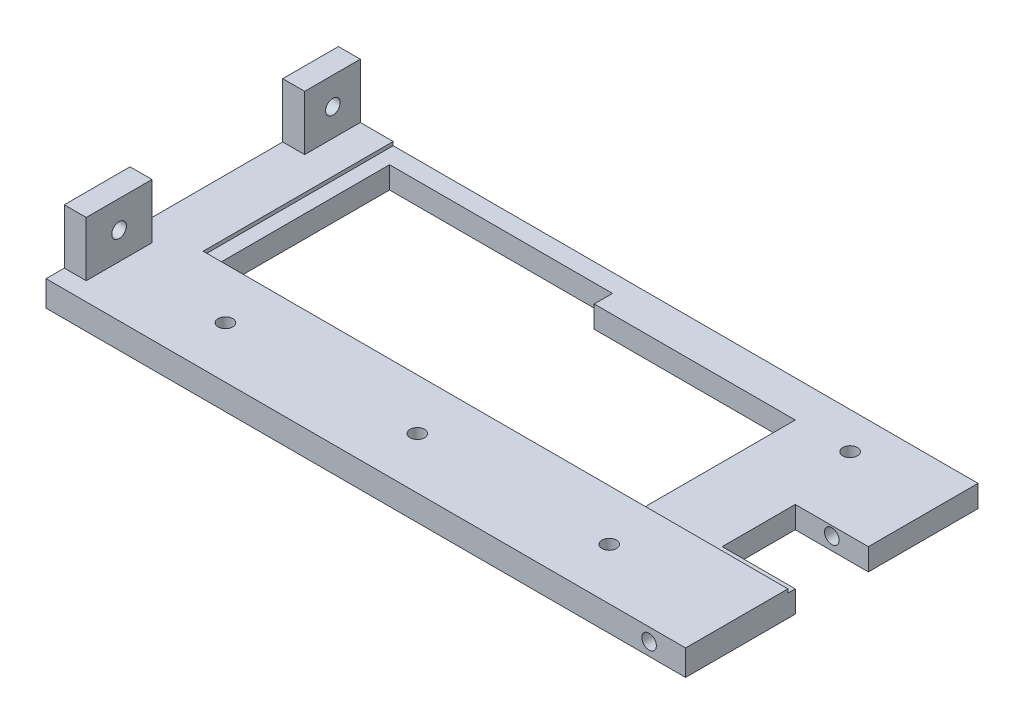
ISO-10303-21;
HEADER;
FILE_DESCRIPTION(('STEP AP214'),'2;1');
FILE_NAME('part.step','',(''),(''),'','','');
FILE_SCHEMA(('AUTOMOTIVE_DESIGN { 1 0 10303 214 1 1 1 1 }'));
ENDSEC;
DATA;
#1=APPLICATION_CONTEXT('core data for automotive mechanical design processes');
#2=APPLICATION_PROTOCOL_DEFINITION('international standard','automotive_design',2000,#1);
#3=PRODUCT_CONTEXT('',#1,'mechanical');
#4=PRODUCT('Part','Part','',(#3));
#5=PRODUCT_RELATED_PRODUCT_CATEGORY('part','',(#4));
#6=PRODUCT_DEFINITION_FORMATION('','',#4);
#7=PRODUCT_DEFINITION_CONTEXT('part definition',#1,'design');
#8=PRODUCT_DEFINITION('design','',#6,#7);
#9=PRODUCT_DEFINITION_SHAPE('','',#8);
#10=(LENGTH_UNIT() NAMED_UNIT(*) SI_UNIT(.MILLI.,.METRE.));
#11=(NAMED_UNIT(*) PLANE_ANGLE_UNIT() SI_UNIT($,.RADIAN.));
#12=(NAMED_UNIT(*) SI_UNIT($,.STERADIAN.) SOLID_ANGLE_UNIT());
#13=UNCERTAINTY_MEASURE_WITH_UNIT(LENGTH_MEASURE(1.E-05),#10,'distance_accuracy_value','');
#14=(GEOMETRIC_REPRESENTATION_CONTEXT(3) GLOBAL_UNCERTAINTY_ASSIGNED_CONTEXT((#13)) GLOBAL_UNIT_ASSIGNED_CONTEXT((#10,
#11,#12)) REPRESENTATION_CONTEXT('',''));
#15=CARTESIAN_POINT('',(0.,0.,0.));
#16=DIRECTION('',(0.,0.,1.));
#17=DIRECTION('',(1.,0.,0.));
#18=AXIS2_PLACEMENT_3D('',#15,#16,#17);
#19=CARTESIAN_POINT('',(85.1165501165501,7.,-33.006993006993));
#20=DIRECTION('',(-1.,0.,0.));
#21=DIRECTION('',(0.,0.,1.));
#22=AXIS2_PLACEMENT_3D('',#19,#20,#21);
#23=PLANE('',#22);
#24=DIRECTION('',(0.,0.,-1.));
#25=VECTOR('',#24,1.);
#26=CARTESIAN_POINT('',(85.1165501165501,6.,18.993006993007));
#27=LINE('',#26,#25);
#28=CARTESIAN_POINT('',(85.1165501165501,6.,-3.006993006993));
#29=VERTEX_POINT('',#28);
#30=CARTESIAN_POINT('',(85.1165501165501,6.,-33.006993006993));
#31=VERTEX_POINT('',#30);
#32=EDGE_CURVE('E388',#29,#31,#27,.T.);
#33=ORIENTED_EDGE('',*,*,#32,.F.);
#34=DIRECTION('',(0.,-1.,0.));
#35=VECTOR('',#34,1.);
#36=CARTESIAN_POINT('',(85.1165501165501,15.,-3.006993006993));
#37=LINE('',#36,#35);
#38=CARTESIAN_POINT('',(85.1165501165501,0.,-3.006993006993));
#39=VERTEX_POINT('',#38);
#40=EDGE_CURVE('E272',#29,#39,#37,.T.);
#41=ORIENTED_EDGE('',*,*,#40,.T.);
#42=DIRECTION('',(0.,0.,-1.));
#43=VECTOR('',#42,1.);
#44=CARTESIAN_POINT('',(85.1165501165501,0.,-33.006993006993));
#45=LINE('',#44,#43);
#46=CARTESIAN_POINT('',(85.1165501165501,0.,-33.006993006993));
#47=VERTEX_POINT('',#46);
#48=EDGE_CURVE('E223',#39,#47,#45,.T.);
#49=ORIENTED_EDGE('',*,*,#48,.T.);
#50=DIRECTION('',(0.,-1.,0.));
#51=VECTOR('',#50,1.);
#52=CARTESIAN_POINT('',(85.1165501165501,7.,-33.006993006993));
#53=LINE('',#52,#51);
#54=EDGE_CURVE('E234',#31,#47,#53,.T.);
#55=ORIENTED_EDGE('',*,*,#54,.F.);
#56=EDGE_LOOP('',(#33,#41,#49,#55));
#57=FACE_BOUND('',#56,.T.);
#58=ADVANCED_FACE('F33',(#57),#23,.F.);
#59=CARTESIAN_POINT('',(0.,7.,0.));
#60=DIRECTION('',(0.,1.,0.));
#61=DIRECTION('',(0.,0.,1.));
#62=AXIS2_PLACEMENT_3D('',#59,#60,#61);
#63=PLANE('',#62);
#64=CARTESIAN_POINT('',(-54.8834498834499,7.,32.893006993007));
#65=DIRECTION('',(0.,1.,0.));
#66=DIRECTION('',(0.,0.,1.));
#67=AXIS2_PLACEMENT_3D('',#64,#65,#66);
#68=CIRCLE('',#67,2.);
#69=CARTESIAN_POINT('',(-54.8834498834499,7.,34.893006993007));
#70=VERTEX_POINT('',#69);
#71=EDGE_CURVE('E246',#70,#70,#68,.T.);
#72=ORIENTED_EDGE('',*,*,#71,.F.);
#73=EDGE_LOOP('',(#72));
#74=FACE_BOUND('',#73,.T.);
#75=CARTESIAN_POINT('',(-2.38344988344989,7.,32.893006993007));
#76=DIRECTION('',(0.,1.,0.));
#77=DIRECTION('',(0.,0.,1.));
#78=AXIS2_PLACEMENT_3D('',#75,#76,#77);
#79=CIRCLE('',#78,2.);
#80=CARTESIAN_POINT('',(-2.38344988344989,7.,34.893006993007));
#81=VERTEX_POINT('',#80);
#82=EDGE_CURVE('E412',#81,#81,#79,.T.);
#83=ORIENTED_EDGE('',*,*,#82,.F.);
#84=EDGE_LOOP('',(#83));
#85=FACE_BOUND('',#84,.T.);
#86=CARTESIAN_POINT('',(50.1165501165501,7.,32.893006993007));
#87=DIRECTION('',(0.,1.,0.));
#88=DIRECTION('',(0.,0.,1.));
#89=AXIS2_PLACEMENT_3D('',#86,#87,#88);
#90=CIRCLE('',#89,2.);
#91=CARTESIAN_POINT('',(50.1165501165501,7.,34.893006993007));
#92=VERTEX_POINT('',#91);
#93=EDGE_CURVE('E406',#92,#92,#90,.T.);
#94=ORIENTED_EDGE('',*,*,#93,.F.);
#95=EDGE_LOOP('',(#94));
#96=FACE_BOUND('',#95,.T.);
#97=DIRECTION('',(0.,0.,-1.));
#98=VECTOR('',#97,1.);
#99=CARTESIAN_POINT('',(-83.8834498834499,7.,41.993006993007));
#100=LINE('',#99,#98);
#101=CARTESIAN_POINT('',(-83.8834498834499,7.,41.993006993007));
#102=VERTEX_POINT('',#101);
#103=CARTESIAN_POINT('',(-83.8834498834499,7.,23.993006993007));
#104=VERTEX_POINT('',#103);
#105=EDGE_CURVE('E303',#102,#104,#100,.T.);
#106=ORIENTED_EDGE('',*,*,#105,.F.);
#107=DIRECTION('',(1.,0.,0.));
#108=VECTOR('',#107,1.);
#109=CARTESIAN_POINT('',(-89.8834498834499,7.,41.993006993007));
#110=LINE('',#109,#108);
#111=CARTESIAN_POINT('',(-89.8834498834499,7.,41.993006993007));
#112=VERTEX_POINT('',#111);
#113=EDGE_CURVE('E290',#112,#102,#110,.T.);
#114=ORIENTED_EDGE('',*,*,#113,.F.);
#115=DIRECTION('',(0.,0.,1.));
#116=VECTOR('',#115,1.);
#117=CARTESIAN_POINT('',(-89.8834498834499,7.,-33.006993006993));
#118=LINE('',#117,#116);
#119=CARTESIAN_POINT('',(-89.8834498834499,7.,46.993006993007));
#120=VERTEX_POINT('',#119);
#121=EDGE_CURVE('E225',#112,#120,#118,.T.);
#122=ORIENTED_EDGE('',*,*,#121,.T.);
#123=DIRECTION('',(1.,0.,0.));
#124=VECTOR('',#123,1.);
#125=CARTESIAN_POINT('',(-89.8834498834499,7.,46.993006993007));
#126=LINE('',#125,#124);
#127=CARTESIAN_POINT('',(85.1165501165501,7.,46.993006993007));
#128=VERTEX_POINT('',#127);
#129=EDGE_CURVE('E420',#120,#128,#126,.T.);
#130=ORIENTED_EDGE('',*,*,#129,.T.);
#131=DIRECTION('',(0.,0.,-1.));
#132=VECTOR('',#131,1.);
#133=CARTESIAN_POINT('',(85.1165501165501,7.,-33.006993006993));
#134=LINE('',#133,#132);
#135=CARTESIAN_POINT('',(85.1165501165501,7.,18.993006993007));
#136=VERTEX_POINT('',#135);
#137=EDGE_CURVE('E422',#128,#136,#134,.T.);
#138=ORIENTED_EDGE('',*,*,#137,.T.);
#139=DIRECTION('',(1.,0.,0.));
#140=VECTOR('',#139,1.);
#141=CARTESIAN_POINT('',(85.1165501165501,7.,18.993006993007));
#142=LINE('',#141,#140);
#143=CARTESIAN_POINT('',(-74.8834498834499,7.,18.993006993007));
#144=VERTEX_POINT('',#143);
#145=EDGE_CURVE('E401',#144,#136,#142,.T.);
#146=ORIENTED_EDGE('',*,*,#145,.F.);
#147=DIRECTION('',(0.,0.,1.));
#148=VECTOR('',#147,1.);
#149=CARTESIAN_POINT('',(-74.8834498834499,7.,18.993006993007));
#150=LINE('',#149,#148);
#151=CARTESIAN_POINT('',(-74.8834498834499,7.,-33.006993006993));
#152=VERTEX_POINT('',#151);
#153=EDGE_CURVE('E384',#152,#144,#150,.T.);
#154=ORIENTED_EDGE('',*,*,#153,.F.);
#155=DIRECTION('',(-1.,0.,0.));
#156=VECTOR('',#155,1.);
#157=CARTESIAN_POINT('',(-89.8834498834499,7.,-33.006993006993));
#158=LINE('',#157,#156);
#159=CARTESIAN_POINT('',(-83.8834498834499,7.,-33.006993006993));
#160=VERTEX_POINT('',#159);
#161=EDGE_CURVE('E235',#152,#160,#158,.T.);
#162=ORIENTED_EDGE('',*,*,#161,.T.);
#163=DIRECTION('',(0.,0.,-1.));
#164=VECTOR('',#163,1.);
#165=CARTESIAN_POINT('',(-83.8834498834499,7.,-33.006993006993));
#166=LINE('',#165,#164);
#167=CARTESIAN_POINT('',(-83.8834498834499,7.,-17.7803002518982));
#168=VERTEX_POINT('',#167);
#169=EDGE_CURVE('E319',#168,#160,#166,.T.);
#170=ORIENTED_EDGE('',*,*,#169,.F.);
#171=DIRECTION('',(1.,0.,0.));
#172=VECTOR('',#171,1.);
#173=CARTESIAN_POINT('',(-89.8834498834499,7.,-17.7803002518982));
#174=LINE('',#173,#172);
#175=CARTESIAN_POINT('',(-89.8834498834499,7.,-17.7803002518982));
#176=VERTEX_POINT('',#175);
#177=EDGE_CURVE('E314',#176,#168,#174,.T.);
#178=ORIENTED_EDGE('',*,*,#177,.F.);
#179=CARTESIAN_POINT('',(-89.8834498834499,7.,23.993006993007));
#180=VERTEX_POINT('',#179);
#181=EDGE_CURVE('E417',#176,#180,#118,.T.);
#182=ORIENTED_EDGE('',*,*,#181,.T.);
#183=DIRECTION('',(-1.,0.,0.));
#184=VECTOR('',#183,1.);
#185=CARTESIAN_POINT('',(-89.8834498834499,7.,23.993006993007));
#186=LINE('',#185,#184);
#187=EDGE_CURVE('E295',#104,#180,#186,.T.);
#188=ORIENTED_EDGE('',*,*,#187,.F.);
#189=EDGE_LOOP('',(#106,#114,#122,#130,#138,#146,#154,#162,#170,#178,#182,#188));
#190=FACE_BOUND('',#189,.T.);
#191=ADVANCED_FACE('F452',(#74,#85,#96,#190),#63,.T.);
#192=CARTESIAN_POINT('',(-89.8834498834499,7.,-33.006993006993));
#193=DIRECTION('',(1.,0.,0.));
#194=DIRECTION('',(0.,0.,-1.));
#195=AXIS2_PLACEMENT_3D('',#192,#193,#194);
#196=PLANE('',#195);
#197=CARTESIAN_POINT('',(-89.8834498834499,14.5,-25.506993006993));
#198=DIRECTION('',(1.,0.,0.));
#199=DIRECTION('',(0.,0.,-1.));
#200=AXIS2_PLACEMENT_3D('',#197,#198,#199);
#201=CIRCLE('',#200,2.);
#202=CARTESIAN_POINT('',(-89.8834498834499,14.5,-27.506993006993));
#203=VERTEX_POINT('',#202);
#204=EDGE_CURVE('E287',#203,#203,#201,.T.);
#205=ORIENTED_EDGE('',*,*,#204,.T.);
#206=EDGE_LOOP('',(#205));
#207=FACE_BOUND('',#206,.T.);
#208=CARTESIAN_POINT('',(-89.8834498834499,14.5,32.993006993007));
#209=DIRECTION('',(1.,0.,0.));
#210=DIRECTION('',(0.,0.,-1.));
#211=AXIS2_PLACEMENT_3D('',#208,#209,#210);
#212=CIRCLE('',#211,2.);
#213=CARTESIAN_POINT('',(-89.8834498834499,14.5,30.993006993007));
#214=VERTEX_POINT('',#213);
#215=EDGE_CURVE('E282',#214,#214,#212,.T.);
#216=ORIENTED_EDGE('',*,*,#215,.T.);
#217=EDGE_LOOP('',(#216));
#218=FACE_BOUND('',#217,.T.);
#219=DIRECTION('',(0.,0.,1.));
#220=VECTOR('',#219,1.);
#221=CARTESIAN_POINT('',(-89.8834498834499,0.,-33.006993006993));
#222=LINE('',#221,#220);
#223=CARTESIAN_POINT('',(-89.8834498834499,0.,-33.006993006993));
#224=VERTEX_POINT('',#223);
#225=CARTESIAN_POINT('',(-89.8834498834499,0.,46.993006993007));
#226=VERTEX_POINT('',#225);
#227=EDGE_CURVE('E252',#224,#226,#222,.T.);
#228=ORIENTED_EDGE('',*,*,#227,.T.);
#229=DIRECTION('',(0.,-1.,0.));
#230=VECTOR('',#229,1.);
#231=CARTESIAN_POINT('',(-89.8834498834499,7.,46.993006993007));
#232=LINE('',#231,#230);
#233=EDGE_CURVE('E239',#120,#226,#232,.T.);
#234=ORIENTED_EDGE('',*,*,#233,.F.);
#235=ORIENTED_EDGE('',*,*,#121,.F.);
#236=DIRECTION('',(0.,-1.,0.));
#237=VECTOR('',#236,1.);
#238=CARTESIAN_POINT('',(-89.8834498834499,22.,41.993006993007));
#239=LINE('',#238,#237);
#240=CARTESIAN_POINT('',(-89.8834498834499,22.,41.993006993007));
#241=VERTEX_POINT('',#240);
#242=EDGE_CURVE('E312',#241,#112,#239,.T.);
#243=ORIENTED_EDGE('',*,*,#242,.F.);
#244=DIRECTION('',(0.,0.,1.));
#245=VECTOR('',#244,1.);
#246=CARTESIAN_POINT('',(-89.8834498834499,22.,41.993006993007));
#247=LINE('',#246,#245);
#248=CARTESIAN_POINT('',(-89.8834498834499,22.,23.993006993007));
#249=VERTEX_POINT('',#248);
#250=EDGE_CURVE('E291',#249,#241,#247,.T.);
#251=ORIENTED_EDGE('',*,*,#250,.F.);
#252=DIRECTION('',(0.,-1.,0.));
#253=VECTOR('',#252,1.);
#254=CARTESIAN_POINT('',(-89.8834498834499,22.,23.993006993007));
#255=LINE('',#254,#253);
#256=EDGE_CURVE('E301',#249,#180,#255,.T.);
#257=ORIENTED_EDGE('',*,*,#256,.T.);
#258=ORIENTED_EDGE('',*,*,#181,.F.);
#259=DIRECTION('',(0.,-1.,0.));
#260=VECTOR('',#259,1.);
#261=CARTESIAN_POINT('',(-89.8834498834499,22.,-17.7803002518982));
#262=LINE('',#261,#260);
#263=CARTESIAN_POINT('',(-89.8834498834499,22.,-17.7803002518982));
#264=VERTEX_POINT('',#263);
#265=EDGE_CURVE('E336',#264,#176,#262,.T.);
#266=ORIENTED_EDGE('',*,*,#265,.F.);
#267=DIRECTION('',(0.,0.,1.));
#268=VECTOR('',#267,1.);
#269=CARTESIAN_POINT('',(-89.8834498834499,22.,-33.006993006993));
#270=LINE('',#269,#268);
#271=CARTESIAN_POINT('',(-89.8834498834499,22.,-33.006993006993));
#272=VERTEX_POINT('',#271);
#273=EDGE_CURVE('E315',#272,#264,#270,.T.);
#274=ORIENTED_EDGE('',*,*,#273,.F.);
#275=DIRECTION('',(0.,-1.,0.));
#276=VECTOR('',#275,1.);
#277=CARTESIAN_POINT('',(-89.8834498834499,7.,-33.006993006993));
#278=LINE('',#277,#276);
#279=EDGE_CURVE('E231',#272,#224,#278,.T.);
#280=ORIENTED_EDGE('',*,*,#279,.T.);
#281=EDGE_LOOP('',(#228,#234,#235,#243,#251,#257,#258,#266,#274,#280));
#282=FACE_BOUND('',#281,.T.);
#283=ADVANCED_FACE('F35',(#207,#218,#282),#196,.F.);
#284=CARTESIAN_POINT('',(-89.8834498834499,7.,46.993006993007));
#285=DIRECTION('',(0.,0.,-1.));
#286=DIRECTION('',(-1.,0.,0.));
#287=AXIS2_PLACEMENT_3D('',#284,#285,#286);
#288=PLANE('',#287);
#289=CARTESIAN_POINT('',(75.1165501165501,3.5,46.993006993007));
#290=DIRECTION('',(0.,0.,1.));
#291=DIRECTION('',(1.,0.,0.));
#292=AXIS2_PLACEMENT_3D('',#289,#290,#291);
#293=CIRCLE('',#292,2.);
#294=CARTESIAN_POINT('',(77.1165501165501,3.5,46.993006993007));
#295=VERTEX_POINT('',#294);
#296=EDGE_CURVE('E262',#295,#295,#293,.T.);
#297=ORIENTED_EDGE('',*,*,#296,.F.);
#298=EDGE_LOOP('',(#297));
#299=FACE_BOUND('',#298,.T.);
#300=DIRECTION('',(1.,0.,0.));
#301=VECTOR('',#300,1.);
#302=CARTESIAN_POINT('',(-89.8834498834499,0.,46.993006993007));
#303=LINE('',#302,#301);
#304=CARTESIAN_POINT('',(85.1165501165501,0.,46.993006993007));
#305=VERTEX_POINT('',#304);
#306=EDGE_CURVE('E227',#226,#305,#303,.T.);
#307=ORIENTED_EDGE('',*,*,#306,.T.);
#308=DIRECTION('',(0.,-1.,0.));
#309=VECTOR('',#308,1.);
#310=CARTESIAN_POINT('',(85.1165501165501,7.,46.993006993007));
#311=LINE('',#310,#309);
#312=EDGE_CURVE('E221',#128,#305,#311,.T.);
#313=ORIENTED_EDGE('',*,*,#312,.F.);
#314=ORIENTED_EDGE('',*,*,#129,.F.);
#315=ORIENTED_EDGE('',*,*,#233,.T.);
#316=EDGE_LOOP('',(#307,#313,#314,#315));
#317=FACE_BOUND('',#316,.T.);
#318=ADVANCED_FACE('F430',(#299,#317),#288,.F.);
#319=CARTESIAN_POINT('',(85.1165501165501,0.,16.993006993007));
#320=VERTEX_POINT('',#319);
#321=EDGE_CURVE('E211',#305,#320,#45,.T.);
#322=ORIENTED_EDGE('',*,*,#321,.T.);
#323=DIRECTION('',(0.,-1.,0.));
#324=VECTOR('',#323,1.);
#325=CARTESIAN_POINT('',(85.1165501165501,15.,16.993006993007));
#326=LINE('',#325,#324);
#327=CARTESIAN_POINT('',(85.1165501165501,6.,16.993006993007));
#328=VERTEX_POINT('',#327);
#329=EDGE_CURVE('E194',#328,#320,#326,.T.);
#330=ORIENTED_EDGE('',*,*,#329,.F.);
#331=CARTESIAN_POINT('',(85.1165501165501,6.,18.993006993007));
#332=VERTEX_POINT('',#331);
#333=EDGE_CURVE('E385',#332,#328,#27,.T.);
#334=ORIENTED_EDGE('',*,*,#333,.F.);
#335=DIRECTION('',(0.,1.,0.));
#336=VECTOR('',#335,1.);
#337=CARTESIAN_POINT('',(85.1165501165501,6.,18.993006993007));
#338=LINE('',#337,#336);
#339=EDGE_CURVE('E403',#332,#136,#338,.T.);
#340=ORIENTED_EDGE('',*,*,#339,.T.);
#341=ORIENTED_EDGE('',*,*,#137,.F.);
#342=ORIENTED_EDGE('',*,*,#312,.T.);
#343=EDGE_LOOP('',(#322,#330,#334,#340,#341,#342));
#344=FACE_BOUND('',#343,.T.);
#345=ADVANCED_FACE('F218',(#344),#23,.F.);
#346=CARTESIAN_POINT('',(-89.8834498834499,7.,-33.006993006993));
#347=DIRECTION('',(0.,0.,1.));
#348=DIRECTION('',(1.,0.,0.));
#349=AXIS2_PLACEMENT_3D('',#346,#347,#348);
#350=PLANE('',#349);
#351=CARTESIAN_POINT('',(75.1165501165501,3.5,-33.006993006993));
#352=DIRECTION('',(0.,0.,1.));
#353=DIRECTION('',(1.,0.,0.));
#354=AXIS2_PLACEMENT_3D('',#351,#352,#353);
#355=CIRCLE('',#354,2.);
#356=CARTESIAN_POINT('',(77.1165501165501,3.5,-33.006993006993));
#357=VERTEX_POINT('',#356);
#358=EDGE_CURVE('E256',#357,#357,#355,.T.);
#359=ORIENTED_EDGE('',*,*,#358,.T.);
#360=EDGE_LOOP('',(#359));
#361=FACE_BOUND('',#360,.T.);
#362=ORIENTED_EDGE('',*,*,#161,.F.);
#363=DIRECTION('',(0.,1.,0.));
#364=VECTOR('',#363,1.);
#365=CARTESIAN_POINT('',(-74.8834498834499,6.,-33.006993006993));
#366=LINE('',#365,#364);
#367=CARTESIAN_POINT('',(-74.8834498834499,6.,-33.006993006993));
#368=VERTEX_POINT('',#367);
#369=EDGE_CURVE('E398',#368,#152,#366,.T.);
#370=ORIENTED_EDGE('',*,*,#369,.F.);
#371=DIRECTION('',(-1.,0.,0.));
#372=VECTOR('',#371,1.);
#373=CARTESIAN_POINT('',(85.1165501165501,6.,-33.006993006993));
#374=LINE('',#373,#372);
#375=EDGE_CURVE('E387',#31,#368,#374,.T.);
#376=ORIENTED_EDGE('',*,*,#375,.F.);
#377=ORIENTED_EDGE('',*,*,#54,.T.);
#378=DIRECTION('',(-1.,0.,0.));
#379=VECTOR('',#378,1.);
#380=CARTESIAN_POINT('',(-89.8834498834499,0.,-33.006993006993));
#381=LINE('',#380,#379);
#382=EDGE_CURVE('E222',#47,#224,#381,.T.);
#383=ORIENTED_EDGE('',*,*,#382,.T.);
#384=ORIENTED_EDGE('',*,*,#279,.F.);
#385=DIRECTION('',(-1.,0.,0.));
#386=VECTOR('',#385,1.);
#387=CARTESIAN_POINT('',(-89.8834498834499,22.,-33.006993006993));
#388=LINE('',#387,#386);
#389=CARTESIAN_POINT('',(-83.8834498834499,22.,-33.006993006993));
#390=VERTEX_POINT('',#389);
#391=EDGE_CURVE('E323',#390,#272,#388,.T.);
#392=ORIENTED_EDGE('',*,*,#391,.F.);
#393=DIRECTION('',(0.,-1.,0.));
#394=VECTOR('',#393,1.);
#395=CARTESIAN_POINT('',(-83.8834498834499,22.,-33.006993006993));
#396=LINE('',#395,#394);
#397=EDGE_CURVE('E326',#390,#160,#396,.T.);
#398=ORIENTED_EDGE('',*,*,#397,.T.);
#399=EDGE_LOOP('',(#362,#370,#376,#377,#383,#384,#392,#398));
#400=FACE_BOUND('',#399,.T.);
#401=ADVANCED_FACE('F435',(#361,#400),#350,.F.);
#402=CARTESIAN_POINT('',(0.,0.,0.));
#403=DIRECTION('',(0.,1.,0.));
#404=DIRECTION('',(0.,0.,1.));
#405=AXIS2_PLACEMENT_3D('',#402,#403,#404);
#406=PLANE('',#405);
#407=CARTESIAN_POINT('',(60.1165501165501,0.,-23.006993006993));
#408=DIRECTION('',(0.,-1.,0.));
#409=DIRECTION('',(0.,0.,-1.));
#410=AXIS2_PLACEMENT_3D('',#407,#408,#409);
#411=CIRCLE('',#410,2.);
#412=CARTESIAN_POINT('',(60.1165501165501,0.,-25.006993006993));
#413=VERTEX_POINT('',#412);
#414=EDGE_CURVE('E630',#413,#413,#411,.T.);
#415=ORIENTED_EDGE('',*,*,#414,.F.);
#416=EDGE_LOOP('',(#415));
#417=FACE_BOUND('',#416,.T.);
#418=DIRECTION('',(0.,0.,-1.));
#419=VECTOR('',#418,1.);
#420=CARTESIAN_POINT('',(-9.8834498834499,0.,0.));
#421=LINE('',#420,#419);
#422=CARTESIAN_POINT('',(-9.8834498834499,0.,-23.006993006993));
#423=VERTEX_POINT('',#422);
#424=CARTESIAN_POINT('',(-9.8834498834499,0.,-28.006993006993));
#425=VERTEX_POINT('',#424);
#426=EDGE_CURVE('E378',#423,#425,#421,.T.);
#427=ORIENTED_EDGE('',*,*,#426,.T.);
#428=DIRECTION('',(-1.,0.,0.));
#429=VECTOR('',#428,1.);
#430=CARTESIAN_POINT('',(0.,0.,-28.006993006993));
#431=LINE('',#430,#429);
#432=CARTESIAN_POINT('',(-70.8834498834499,0.,-28.006993006993));
#433=VERTEX_POINT('',#432);
#434=EDGE_CURVE('E381',#425,#433,#431,.T.);
#435=ORIENTED_EDGE('',*,*,#434,.T.);
#436=DIRECTION('',(0.,0.,1.));
#437=VECTOR('',#436,1.);
#438=CARTESIAN_POINT('',(-70.8834498834499,0.,0.));
#439=LINE('',#438,#437);
#440=CARTESIAN_POINT('',(-70.8834498834499,0.,18.993006993007));
#441=VERTEX_POINT('',#440);
#442=EDGE_CURVE('E357',#433,#441,#439,.T.);
#443=ORIENTED_EDGE('',*,*,#442,.T.);
#444=DIRECTION('',(1.,0.,0.));
#445=VECTOR('',#444,1.);
#446=CARTESIAN_POINT('',(0.,0.,18.993006993007));
#447=LINE('',#446,#445);
#448=CARTESIAN_POINT('',(45.1165501165501,0.,18.993006993007));
#449=VERTEX_POINT('',#448);
#450=EDGE_CURVE('E369',#441,#449,#447,.T.);
#451=ORIENTED_EDGE('',*,*,#450,.T.);
#452=DIRECTION('',(0.,0.,-1.));
#453=VECTOR('',#452,1.);
#454=CARTESIAN_POINT('',(45.1165501165501,0.,0.));
#455=LINE('',#454,#453);
#456=CARTESIAN_POINT('',(45.1165501165501,0.,-23.006993006993));
#457=VERTEX_POINT('',#456);
#458=EDGE_CURVE('E372',#449,#457,#455,.T.);
#459=ORIENTED_EDGE('',*,*,#458,.T.);
#460=DIRECTION('',(-1.,0.,0.));
#461=VECTOR('',#460,1.);
#462=CARTESIAN_POINT('',(0.,0.,-23.006993006993));
#463=LINE('',#462,#461);
#464=EDGE_CURVE('E375',#457,#423,#463,.T.);
#465=ORIENTED_EDGE('',*,*,#464,.T.);
#466=EDGE_LOOP('',(#427,#435,#443,#451,#459,#465));
#467=FACE_BOUND('',#466,.T.);
#468=CARTESIAN_POINT('',(-54.8834498834499,0.,32.893006993007));
#469=DIRECTION('',(0.,1.,0.));
#470=DIRECTION('',(0.,0.,1.));
#471=AXIS2_PLACEMENT_3D('',#468,#469,#470);
#472=CIRCLE('',#471,2.);
#473=CARTESIAN_POINT('',(-54.8834498834499,0.,34.893006993007));
#474=VERTEX_POINT('',#473);
#475=EDGE_CURVE('E249',#474,#474,#472,.T.);
#476=ORIENTED_EDGE('',*,*,#475,.T.);
#477=EDGE_LOOP('',(#476));
#478=FACE_BOUND('',#477,.T.);
#479=CARTESIAN_POINT('',(-2.38344988344989,0.,32.893006993007));
#480=DIRECTION('',(0.,1.,0.));
#481=DIRECTION('',(0.,0.,1.));
#482=AXIS2_PLACEMENT_3D('',#479,#480,#481);
#483=CIRCLE('',#482,2.);
#484=CARTESIAN_POINT('',(-2.38344988344989,0.,34.893006993007));
#485=VERTEX_POINT('',#484);
#486=EDGE_CURVE('E245',#485,#485,#483,.T.);
#487=ORIENTED_EDGE('',*,*,#486,.T.);
#488=EDGE_LOOP('',(#487));
#489=FACE_BOUND('',#488,.T.);
#490=CARTESIAN_POINT('',(50.1165501165501,0.,32.893006993007));
#491=DIRECTION('',(0.,1.,0.));
#492=DIRECTION('',(0.,0.,1.));
#493=AXIS2_PLACEMENT_3D('',#490,#491,#492);
#494=CIRCLE('',#493,2.);
#495=CARTESIAN_POINT('',(50.1165501165501,0.,34.893006993007));
#496=VERTEX_POINT('',#495);
#497=EDGE_CURVE('E242',#496,#496,#494,.T.);
#498=ORIENTED_EDGE('',*,*,#497,.T.);
#499=EDGE_LOOP('',(#498));
#500=FACE_BOUND('',#499,.T.);
#501=ORIENTED_EDGE('',*,*,#48,.F.);
#502=DIRECTION('',(1.,0.,0.));
#503=VECTOR('',#502,1.);
#504=CARTESIAN_POINT('',(85.1165501165501,0.,-3.006993006993));
#505=LINE('',#504,#503);
#506=CARTESIAN_POINT('',(65.1165501165501,0.,-3.006993006993));
#507=VERTEX_POINT('',#506);
#508=EDGE_CURVE('E205',#507,#39,#505,.T.);
#509=ORIENTED_EDGE('',*,*,#508,.F.);
#510=DIRECTION('',(0.,0.,-1.));
#511=VECTOR('',#510,1.);
#512=CARTESIAN_POINT('',(65.1165501165501,0.,16.993006993007));
#513=LINE('',#512,#511);
#514=CARTESIAN_POINT('',(65.1165501165501,0.,16.993006993007));
#515=VERTEX_POINT('',#514);
#516=EDGE_CURVE('E214',#515,#507,#513,.T.);
#517=ORIENTED_EDGE('',*,*,#516,.F.);
#518=DIRECTION('',(-1.,0.,0.));
#519=VECTOR('',#518,1.);
#520=CARTESIAN_POINT('',(85.1165501165501,0.,16.993006993007));
#521=LINE('',#520,#519);
#522=EDGE_CURVE('E197',#320,#515,#521,.T.);
#523=ORIENTED_EDGE('',*,*,#522,.F.);
#524=ORIENTED_EDGE('',*,*,#321,.F.);
#525=ORIENTED_EDGE('',*,*,#306,.F.);
#526=ORIENTED_EDGE('',*,*,#227,.F.);
#527=ORIENTED_EDGE('',*,*,#382,.F.);
#528=EDGE_LOOP('',(#501,#509,#517,#523,#524,#525,#526,#527));
#529=FACE_BOUND('',#528,.T.);
#530=ADVANCED_FACE('F210',(#417,#467,#478,#489,#500,#529),#406,.F.);
#531=CARTESIAN_POINT('',(50.1165501165501,-3.,32.893006993007));
#532=DIRECTION('',(0.,1.,0.));
#533=DIRECTION('',(0.,0.,1.));
#534=AXIS2_PLACEMENT_3D('',#531,#532,#533);
#535=CYLINDRICAL_SURFACE('',#534,2.);
#536=ORIENTED_EDGE('',*,*,#93,.T.);
#537=EDGE_LOOP('',(#536));
#538=FACE_BOUND('',#537,.T.);
#539=ORIENTED_EDGE('',*,*,#497,.F.);
#540=EDGE_LOOP('',(#539));
#541=FACE_BOUND('',#540,.T.);
#542=ADVANCED_FACE('F602',(#538,#541),#535,.F.);
#543=CARTESIAN_POINT('',(-2.38344988344989,-3.,32.893006993007));
#544=DIRECTION('',(0.,1.,0.));
#545=DIRECTION('',(0.,0.,1.));
#546=AXIS2_PLACEMENT_3D('',#543,#544,#545);
#547=CYLINDRICAL_SURFACE('',#546,2.);
#548=ORIENTED_EDGE('',*,*,#82,.T.);
#549=EDGE_LOOP('',(#548));
#550=FACE_BOUND('',#549,.T.);
#551=ORIENTED_EDGE('',*,*,#486,.F.);
#552=EDGE_LOOP('',(#551));
#553=FACE_BOUND('',#552,.T.);
#554=ADVANCED_FACE('F640',(#550,#553),#547,.F.);
#555=CARTESIAN_POINT('',(-54.8834498834499,-3.,32.893006993007));
#556=DIRECTION('',(0.,1.,0.));
#557=DIRECTION('',(0.,0.,1.));
#558=AXIS2_PLACEMENT_3D('',#555,#556,#557);
#559=CYLINDRICAL_SURFACE('',#558,2.);
#560=ORIENTED_EDGE('',*,*,#71,.T.);
#561=EDGE_LOOP('',(#560));
#562=FACE_BOUND('',#561,.T.);
#563=ORIENTED_EDGE('',*,*,#475,.F.);
#564=EDGE_LOOP('',(#563));
#565=FACE_BOUND('',#564,.T.);
#566=ADVANCED_FACE('F647',(#562,#565),#559,.F.);
#567=CARTESIAN_POINT('',(85.1165501165501,6.,18.993006993007));
#568=DIRECTION('',(0.,0.,1.));
#569=DIRECTION('',(1.,0.,0.));
#570=AXIS2_PLACEMENT_3D('',#567,#568,#569);
#571=PLANE('',#570);
#572=ORIENTED_EDGE('',*,*,#145,.T.);
#573=ORIENTED_EDGE('',*,*,#339,.F.);
#574=DIRECTION('',(1.,0.,0.));
#575=VECTOR('',#574,1.);
#576=CARTESIAN_POINT('',(85.1165501165501,6.,18.993006993007));
#577=LINE('',#576,#575);
#578=CARTESIAN_POINT('',(45.1165501165501,6.,18.993006993007));
#579=VERTEX_POINT('',#578);
#580=EDGE_CURVE('E394',#579,#332,#577,.T.);
#581=ORIENTED_EDGE('',*,*,#580,.F.);
#582=DIRECTION('',(0.,1.,0.));
#583=VECTOR('',#582,1.);
#584=CARTESIAN_POINT('',(45.1165501165501,-4.,18.993006993007));
#585=LINE('',#584,#583);
#586=EDGE_CURVE('E364',#449,#579,#585,.T.);
#587=ORIENTED_EDGE('',*,*,#586,.F.);
#588=ORIENTED_EDGE('',*,*,#450,.F.);
#589=DIRECTION('',(0.,1.,0.));
#590=VECTOR('',#589,1.);
#591=CARTESIAN_POINT('',(-70.8834498834499,-4.,18.993006993007));
#592=LINE('',#591,#590);
#593=CARTESIAN_POINT('',(-70.8834498834499,6.,18.993006993007));
#594=VERTEX_POINT('',#593);
#595=EDGE_CURVE('E353',#441,#594,#592,.T.);
#596=ORIENTED_EDGE('',*,*,#595,.T.);
#597=CARTESIAN_POINT('',(-74.8834498834499,6.,18.993006993007));
#598=VERTEX_POINT('',#597);
#599=EDGE_CURVE('E395',#598,#594,#577,.T.);
#600=ORIENTED_EDGE('',*,*,#599,.F.);
#601=DIRECTION('',(0.,1.,0.));
#602=VECTOR('',#601,1.);
#603=CARTESIAN_POINT('',(-74.8834498834499,6.,18.993006993007));
#604=LINE('',#603,#602);
#605=EDGE_CURVE('E407',#598,#144,#604,.T.);
#606=ORIENTED_EDGE('',*,*,#605,.T.);
#607=EDGE_LOOP('',(#572,#573,#581,#587,#588,#596,#600,#606));
#608=FACE_BOUND('',#607,.T.);
#609=ADVANCED_FACE('F653',(#608),#571,.F.);
#610=CARTESIAN_POINT('',(-74.8834498834499,6.,18.993006993007));
#611=DIRECTION('',(-1.,0.,0.));
#612=DIRECTION('',(0.,0.,1.));
#613=AXIS2_PLACEMENT_3D('',#610,#611,#612);
#614=PLANE('',#613);
#615=ORIENTED_EDGE('',*,*,#153,.T.);
#616=ORIENTED_EDGE('',*,*,#605,.F.);
#617=DIRECTION('',(0.,0.,1.));
#618=VECTOR('',#617,1.);
#619=CARTESIAN_POINT('',(-74.8834498834499,6.,18.993006993007));
#620=LINE('',#619,#618);
#621=EDGE_CURVE('E391',#368,#598,#620,.T.);
#622=ORIENTED_EDGE('',*,*,#621,.F.);
#623=ORIENTED_EDGE('',*,*,#369,.T.);
#624=EDGE_LOOP('',(#615,#616,#622,#623));
#625=FACE_BOUND('',#624,.T.);
#626=ADVANCED_FACE('F613',(#625),#614,.F.);
#627=CARTESIAN_POINT('',(0.,6.,0.));
#628=DIRECTION('',(0.,1.,0.));
#629=DIRECTION('',(0.,0.,1.));
#630=AXIS2_PLACEMENT_3D('',#627,#628,#629);
#631=PLANE('',#630);
#632=CARTESIAN_POINT('',(60.1165501165501,6.,-23.006993006993));
#633=DIRECTION('',(0.,1.,0.));
#634=DIRECTION('',(0.,0.,1.));
#635=AXIS2_PLACEMENT_3D('',#632,#633,#634);
#636=CIRCLE('',#635,2.);
#637=CARTESIAN_POINT('',(60.1165501165501,6.,-21.006993006993));
#638=VERTEX_POINT('',#637);
#639=EDGE_CURVE('E37',#638,#638,#636,.T.);
#640=ORIENTED_EDGE('',*,*,#639,.F.);
#641=EDGE_LOOP('',(#640));
#642=FACE_BOUND('',#641,.T.);
#643=DIRECTION('',(-1.,0.,0.));
#644=VECTOR('',#643,1.);
#645=CARTESIAN_POINT('',(0.,6.,-3.00699300699301));
#646=LINE('',#645,#644);
#647=CARTESIAN_POINT('',(65.1165501165501,6.,-3.006993006993));
#648=VERTEX_POINT('',#647);
#649=EDGE_CURVE('E11',#29,#648,#646,.T.);
#650=ORIENTED_EDGE('',*,*,#649,.F.);
#651=ORIENTED_EDGE('',*,*,#32,.T.);
#652=ORIENTED_EDGE('',*,*,#375,.T.);
#653=ORIENTED_EDGE('',*,*,#621,.T.);
#654=ORIENTED_EDGE('',*,*,#599,.T.);
#655=DIRECTION('',(0.,0.,1.));
#656=VECTOR('',#655,1.);
#657=CARTESIAN_POINT('',(-70.8834498834499,6.,-23.006993006993));
#658=LINE('',#657,#656);
#659=CARTESIAN_POINT('',(-70.8834498834499,6.,-28.006993006993));
#660=VERTEX_POINT('',#659);
#661=EDGE_CURVE('E339',#660,#594,#658,.T.);
#662=ORIENTED_EDGE('',*,*,#661,.F.);
#663=DIRECTION('',(-1.,0.,0.));
#664=VECTOR('',#663,1.);
#665=CARTESIAN_POINT('',(-70.8834498834499,6.,-28.006993006993));
#666=LINE('',#665,#664);
#667=CARTESIAN_POINT('',(-9.8834498834499,6.,-28.006993006993));
#668=VERTEX_POINT('',#667);
#669=EDGE_CURVE('E351',#668,#660,#666,.T.);
#670=ORIENTED_EDGE('',*,*,#669,.F.);
#671=DIRECTION('',(0.,0.,-1.));
#672=VECTOR('',#671,1.);
#673=CARTESIAN_POINT('',(-9.8834498834499,6.,-23.006993006993));
#674=LINE('',#673,#672);
#675=CARTESIAN_POINT('',(-9.8834498834499,6.,-23.006993006993));
#676=VERTEX_POINT('',#675);
#677=EDGE_CURVE('E348',#676,#668,#674,.T.);
#678=ORIENTED_EDGE('',*,*,#677,.F.);
#679=DIRECTION('',(-1.,0.,0.));
#680=VECTOR('',#679,1.);
#681=CARTESIAN_POINT('',(-9.8834498834499,6.,-23.006993006993));
#682=LINE('',#681,#680);
#683=CARTESIAN_POINT('',(45.1165501165501,6.,-23.006993006993));
#684=VERTEX_POINT('',#683);
#685=EDGE_CURVE('E345',#684,#676,#682,.T.);
#686=ORIENTED_EDGE('',*,*,#685,.F.);
#687=DIRECTION('',(0.,0.,-1.));
#688=VECTOR('',#687,1.);
#689=CARTESIAN_POINT('',(45.1165501165501,6.,-23.006993006993));
#690=LINE('',#689,#688);
#691=EDGE_CURVE('E342',#579,#684,#690,.T.);
#692=ORIENTED_EDGE('',*,*,#691,.F.);
#693=ORIENTED_EDGE('',*,*,#580,.T.);
#694=ORIENTED_EDGE('',*,*,#333,.T.);
#695=DIRECTION('',(1.,0.,0.));
#696=VECTOR('',#695,1.);
#697=CARTESIAN_POINT('',(0.,6.,16.993006993007));
#698=LINE('',#697,#696);
#699=CARTESIAN_POINT('',(65.1165501165501,6.,16.993006993007));
#700=VERTEX_POINT('',#699);
#701=EDGE_CURVE('E200',#700,#328,#698,.T.);
#702=ORIENTED_EDGE('',*,*,#701,.F.);
#703=DIRECTION('',(0.,0.,1.));
#704=VECTOR('',#703,1.);
#705=CARTESIAN_POINT('',(65.1165501165501,6.,0.));
#706=LINE('',#705,#704);
#707=EDGE_CURVE('E42',#648,#700,#706,.T.);
#708=ORIENTED_EDGE('',*,*,#707,.F.);
#709=EDGE_LOOP('',(#650,#651,#652,#653,#654,#662,#670,#678,#686,#692,#693,#694,#702,#708));
#710=FACE_BOUND('',#709,.T.);
#711=ADVANCED_FACE('F608',(#642,#710),#631,.T.);
#712=CARTESIAN_POINT('',(-70.8834498834499,-4.,-28.006993006993));
#713=DIRECTION('',(0.,0.,-1.));
#714=DIRECTION('',(-1.,0.,0.));
#715=AXIS2_PLACEMENT_3D('',#712,#713,#714);
#716=PLANE('',#715);
#717=DIRECTION('',(0.,1.,0.));
#718=VECTOR('',#717,1.);
#719=CARTESIAN_POINT('',(-9.8834498834499,-4.,-28.006993006993));
#720=LINE('',#719,#718);
#721=EDGE_CURVE('E358',#425,#668,#720,.T.);
#722=ORIENTED_EDGE('',*,*,#721,.T.);
#723=ORIENTED_EDGE('',*,*,#669,.T.);
#724=DIRECTION('',(0.,1.,0.));
#725=VECTOR('',#724,1.);
#726=CARTESIAN_POINT('',(-70.8834498834499,-4.,-28.006993006993));
#727=LINE('',#726,#725);
#728=EDGE_CURVE('E354',#433,#660,#727,.T.);
#729=ORIENTED_EDGE('',*,*,#728,.F.);
#730=ORIENTED_EDGE('',*,*,#434,.F.);
#731=EDGE_LOOP('',(#722,#723,#729,#730));
#732=FACE_BOUND('',#731,.T.);
#733=ADVANCED_FACE('F612',(#732),#716,.F.);
#734=CARTESIAN_POINT('',(-9.8834498834499,-4.,-23.006993006993));
#735=DIRECTION('',(1.,0.,0.));
#736=DIRECTION('',(0.,0.,-1.));
#737=AXIS2_PLACEMENT_3D('',#734,#735,#736);
#738=PLANE('',#737);
#739=DIRECTION('',(0.,1.,0.));
#740=VECTOR('',#739,1.);
#741=CARTESIAN_POINT('',(-9.8834498834499,-4.,-23.006993006993));
#742=LINE('',#741,#740);
#743=EDGE_CURVE('E360',#423,#676,#742,.T.);
#744=ORIENTED_EDGE('',*,*,#743,.T.);
#745=ORIENTED_EDGE('',*,*,#677,.T.);
#746=ORIENTED_EDGE('',*,*,#721,.F.);
#747=ORIENTED_EDGE('',*,*,#426,.F.);
#748=EDGE_LOOP('',(#744,#745,#746,#747));
#749=FACE_BOUND('',#748,.T.);
#750=ADVANCED_FACE('F666',(#749),#738,.F.);
#751=CARTESIAN_POINT('',(-9.8834498834499,-4.,-23.006993006993));
#752=DIRECTION('',(0.,0.,-1.));
#753=DIRECTION('',(-1.,0.,0.));
#754=AXIS2_PLACEMENT_3D('',#751,#752,#753);
#755=PLANE('',#754);
#756=DIRECTION('',(0.,1.,0.));
#757=VECTOR('',#756,1.);
#758=CARTESIAN_POINT('',(45.1165501165501,-4.,-23.006993006993));
#759=LINE('',#758,#757);
#760=EDGE_CURVE('E362',#457,#684,#759,.T.);
#761=ORIENTED_EDGE('',*,*,#760,.T.);
#762=ORIENTED_EDGE('',*,*,#685,.T.);
#763=ORIENTED_EDGE('',*,*,#743,.F.);
#764=ORIENTED_EDGE('',*,*,#464,.F.);
#765=EDGE_LOOP('',(#761,#762,#763,#764));
#766=FACE_BOUND('',#765,.T.);
#767=ADVANCED_FACE('F662',(#766),#755,.F.);
#768=CARTESIAN_POINT('',(45.1165501165501,-4.,-23.006993006993));
#769=DIRECTION('',(1.,0.,0.));
#770=DIRECTION('',(0.,0.,-1.));
#771=AXIS2_PLACEMENT_3D('',#768,#769,#770);
#772=PLANE('',#771);
#773=ORIENTED_EDGE('',*,*,#586,.T.);
#774=ORIENTED_EDGE('',*,*,#691,.T.);
#775=ORIENTED_EDGE('',*,*,#760,.F.);
#776=ORIENTED_EDGE('',*,*,#458,.F.);
#777=EDGE_LOOP('',(#773,#774,#775,#776));
#778=FACE_BOUND('',#777,.T.);
#779=ADVANCED_FACE('F465',(#778),#772,.F.);
#780=CARTESIAN_POINT('',(-70.8834498834499,-4.,-23.006993006993));
#781=DIRECTION('',(-1.,0.,0.));
#782=DIRECTION('',(0.,0.,1.));
#783=AXIS2_PLACEMENT_3D('',#780,#781,#782);
#784=PLANE('',#783);
#785=ORIENTED_EDGE('',*,*,#728,.T.);
#786=ORIENTED_EDGE('',*,*,#661,.T.);
#787=ORIENTED_EDGE('',*,*,#595,.F.);
#788=ORIENTED_EDGE('',*,*,#442,.F.);
#789=EDGE_LOOP('',(#785,#786,#787,#788));
#790=FACE_BOUND('',#789,.T.);
#791=ADVANCED_FACE('F457',(#790),#784,.F.);
#792=CARTESIAN_POINT('',(-89.8834498834499,22.,-17.7803002518982));
#793=DIRECTION('',(0.,0.,-1.));
#794=DIRECTION('',(-1.,0.,0.));
#795=AXIS2_PLACEMENT_3D('',#792,#793,#794);
#796=PLANE('',#795);
#797=ORIENTED_EDGE('',*,*,#177,.T.);
#798=DIRECTION('',(0.,-1.,0.));
#799=VECTOR('',#798,1.);
#800=CARTESIAN_POINT('',(-83.8834498834499,22.,-17.7803002518982));
#801=LINE('',#800,#799);
#802=CARTESIAN_POINT('',(-83.8834498834499,22.,-17.7803002518982));
#803=VERTEX_POINT('',#802);
#804=EDGE_CURVE('E333',#803,#168,#801,.T.);
#805=ORIENTED_EDGE('',*,*,#804,.F.);
#806=DIRECTION('',(1.,0.,0.));
#807=VECTOR('',#806,1.);
#808=CARTESIAN_POINT('',(-89.8834498834499,22.,-17.7803002518982));
#809=LINE('',#808,#807);
#810=EDGE_CURVE('E318',#264,#803,#809,.T.);
#811=ORIENTED_EDGE('',*,*,#810,.F.);
#812=ORIENTED_EDGE('',*,*,#265,.T.);
#813=EDGE_LOOP('',(#797,#805,#811,#812));
#814=FACE_BOUND('',#813,.T.);
#815=ADVANCED_FACE('F455',(#814),#796,.F.);
#816=CARTESIAN_POINT('',(-83.8834498834499,22.,-33.006993006993));
#817=DIRECTION('',(-1.,0.,0.));
#818=DIRECTION('',(0.,0.,1.));
#819=AXIS2_PLACEMENT_3D('',#816,#817,#818);
#820=PLANE('',#819);
#821=CARTESIAN_POINT('',(-83.8834498834499,14.5,-25.506993006993));
#822=DIRECTION('',(1.,0.,0.));
#823=DIRECTION('',(0.,0.,-1.));
#824=AXIS2_PLACEMENT_3D('',#821,#822,#823);
#825=CIRCLE('',#824,2.);
#826=CARTESIAN_POINT('',(-83.8834498834499,14.5,-27.506993006993));
#827=VERTEX_POINT('',#826);
#828=EDGE_CURVE('E279',#827,#827,#825,.T.);
#829=ORIENTED_EDGE('',*,*,#828,.F.);
#830=EDGE_LOOP('',(#829));
#831=FACE_BOUND('',#830,.T.);
#832=ORIENTED_EDGE('',*,*,#169,.T.);
#833=ORIENTED_EDGE('',*,*,#397,.F.);
#834=DIRECTION('',(0.,0.,-1.));
#835=VECTOR('',#834,1.);
#836=CARTESIAN_POINT('',(-83.8834498834499,22.,-33.006993006993));
#837=LINE('',#836,#835);
#838=EDGE_CURVE('E321',#803,#390,#837,.T.);
#839=ORIENTED_EDGE('',*,*,#838,.F.);
#840=ORIENTED_EDGE('',*,*,#804,.T.);
#841=EDGE_LOOP('',(#832,#833,#839,#840));
#842=FACE_BOUND('',#841,.T.);
#843=ADVANCED_FACE('F449',(#831,#842),#820,.F.);
#844=CARTESIAN_POINT('',(0.,22.,0.));
#845=DIRECTION('',(0.,1.,0.));
#846=DIRECTION('',(0.,0.,1.));
#847=AXIS2_PLACEMENT_3D('',#844,#845,#846);
#848=PLANE('',#847);
#849=ORIENTED_EDGE('',*,*,#273,.T.);
#850=ORIENTED_EDGE('',*,*,#810,.T.);
#851=ORIENTED_EDGE('',*,*,#838,.T.);
#852=ORIENTED_EDGE('',*,*,#391,.T.);
#853=EDGE_LOOP('',(#849,#850,#851,#852));
#854=FACE_BOUND('',#853,.T.);
#855=ADVANCED_FACE('F443',(#854),#848,.T.);
#856=CARTESIAN_POINT('',(-89.8834498834499,22.,41.993006993007));
#857=DIRECTION('',(0.,0.,-1.));
#858=DIRECTION('',(-1.,0.,0.));
#859=AXIS2_PLACEMENT_3D('',#856,#857,#858);
#860=PLANE('',#859);
#861=ORIENTED_EDGE('',*,*,#113,.T.);
#862=DIRECTION('',(0.,-1.,0.));
#863=VECTOR('',#862,1.);
#864=CARTESIAN_POINT('',(-83.8834498834499,22.,41.993006993007));
#865=LINE('',#864,#863);
#866=CARTESIAN_POINT('',(-83.8834498834499,22.,41.993006993007));
#867=VERTEX_POINT('',#866);
#868=EDGE_CURVE('E309',#867,#102,#865,.T.);
#869=ORIENTED_EDGE('',*,*,#868,.F.);
#870=DIRECTION('',(1.,0.,0.));
#871=VECTOR('',#870,1.);
#872=CARTESIAN_POINT('',(-89.8834498834499,22.,41.993006993007));
#873=LINE('',#872,#871);
#874=EDGE_CURVE('E294',#241,#867,#873,.T.);
#875=ORIENTED_EDGE('',*,*,#874,.F.);
#876=ORIENTED_EDGE('',*,*,#242,.T.);
#877=EDGE_LOOP('',(#861,#869,#875,#876));
#878=FACE_BOUND('',#877,.T.);
#879=ADVANCED_FACE('F533',(#878),#860,.F.);
#880=CARTESIAN_POINT('',(-83.8834498834499,22.,41.993006993007));
#881=DIRECTION('',(-1.,0.,0.));
#882=DIRECTION('',(0.,0.,1.));
#883=AXIS2_PLACEMENT_3D('',#880,#881,#882);
#884=PLANE('',#883);
#885=CARTESIAN_POINT('',(-83.8834498834499,14.5,32.993006993007));
#886=DIRECTION('',(1.,0.,0.));
#887=DIRECTION('',(0.,0.,-1.));
#888=AXIS2_PLACEMENT_3D('',#885,#886,#887);
#889=CIRCLE('',#888,2.);
#890=CARTESIAN_POINT('',(-83.8834498834499,14.5,30.993006993007));
#891=VERTEX_POINT('',#890);
#892=EDGE_CURVE('E275',#891,#891,#889,.T.);
#893=ORIENTED_EDGE('',*,*,#892,.F.);
#894=EDGE_LOOP('',(#893));
#895=FACE_BOUND('',#894,.T.);
#896=ORIENTED_EDGE('',*,*,#105,.T.);
#897=DIRECTION('',(0.,-1.,0.));
#898=VECTOR('',#897,1.);
#899=CARTESIAN_POINT('',(-83.8834498834499,22.,23.993006993007));
#900=LINE('',#899,#898);
#901=CARTESIAN_POINT('',(-83.8834498834499,22.,23.993006993007));
#902=VERTEX_POINT('',#901);
#903=EDGE_CURVE('E58',#902,#104,#900,.T.);
#904=ORIENTED_EDGE('',*,*,#903,.F.);
#905=DIRECTION('',(0.,0.,-1.));
#906=VECTOR('',#905,1.);
#907=CARTESIAN_POINT('',(-83.8834498834499,22.,41.993006993007));
#908=LINE('',#907,#906);
#909=EDGE_CURVE('E297',#867,#902,#908,.T.);
#910=ORIENTED_EDGE('',*,*,#909,.F.);
#911=ORIENTED_EDGE('',*,*,#868,.T.);
#912=EDGE_LOOP('',(#896,#904,#910,#911));
#913=FACE_BOUND('',#912,.T.);
#914=ADVANCED_FACE('F530',(#895,#913),#884,.F.);
#915=CARTESIAN_POINT('',(-89.8834498834499,22.,23.993006993007));
#916=DIRECTION('',(0.,0.,1.));
#917=DIRECTION('',(1.,0.,0.));
#918=AXIS2_PLACEMENT_3D('',#915,#916,#917);
#919=PLANE('',#918);
#920=ORIENTED_EDGE('',*,*,#187,.T.);
#921=ORIENTED_EDGE('',*,*,#256,.F.);
#922=DIRECTION('',(-1.,0.,0.));
#923=VECTOR('',#922,1.);
#924=CARTESIAN_POINT('',(-89.8834498834499,22.,23.993006993007));
#925=LINE('',#924,#923);
#926=EDGE_CURVE('E299',#902,#249,#925,.T.);
#927=ORIENTED_EDGE('',*,*,#926,.F.);
#928=ORIENTED_EDGE('',*,*,#903,.T.);
#929=EDGE_LOOP('',(#920,#921,#927,#928));
#930=FACE_BOUND('',#929,.T.);
#931=ADVANCED_FACE('F526',(#930),#919,.F.);
#932=CARTESIAN_POINT('',(0.,22.,0.));
#933=DIRECTION('',(0.,-1.,0.));
#934=DIRECTION('',(0.,0.,-1.));
#935=AXIS2_PLACEMENT_3D('',#932,#933,#934);
#936=PLANE('',#935);
#937=ORIENTED_EDGE('',*,*,#250,.T.);
#938=ORIENTED_EDGE('',*,*,#874,.T.);
#939=ORIENTED_EDGE('',*,*,#909,.T.);
#940=ORIENTED_EDGE('',*,*,#926,.T.);
#941=EDGE_LOOP('',(#937,#938,#939,#940));
#942=FACE_BOUND('',#941,.T.);
#943=ADVANCED_FACE('F522',(#942),#936,.F.);
#944=CARTESIAN_POINT('',(-98.8834498834499,14.5,32.993006993007));
#945=DIRECTION('',(1.,0.,0.));
#946=DIRECTION('',(0.,0.,-1.));
#947=AXIS2_PLACEMENT_3D('',#944,#945,#946);
#948=CYLINDRICAL_SURFACE('',#947,2.);
#949=ORIENTED_EDGE('',*,*,#892,.T.);
#950=EDGE_LOOP('',(#949));
#951=FACE_BOUND('',#950,.T.);
#952=ORIENTED_EDGE('',*,*,#215,.F.);
#953=EDGE_LOOP('',(#952));
#954=FACE_BOUND('',#953,.T.);
#955=ADVANCED_FACE('F518',(#951,#954),#948,.F.);
#956=CARTESIAN_POINT('',(-98.8834498834499,14.5,-25.506993006993));
#957=DIRECTION('',(1.,0.,0.));
#958=DIRECTION('',(0.,0.,-1.));
#959=AXIS2_PLACEMENT_3D('',#956,#957,#958);
#960=CYLINDRICAL_SURFACE('',#959,2.);
#961=ORIENTED_EDGE('',*,*,#828,.T.);
#962=EDGE_LOOP('',(#961));
#963=FACE_BOUND('',#962,.T.);
#964=ORIENTED_EDGE('',*,*,#204,.F.);
#965=EDGE_LOOP('',(#964));
#966=FACE_BOUND('',#965,.T.);
#967=ADVANCED_FACE('F511',(#963,#966),#960,.F.);
#968=CARTESIAN_POINT('',(85.1165501165501,15.,-3.006993006993));
#969=DIRECTION('',(0.,0.,-1.));
#970=DIRECTION('',(-1.,0.,0.));
#971=AXIS2_PLACEMENT_3D('',#968,#969,#970);
#972=PLANE('',#971);
#973=CARTESIAN_POINT('',(75.1165501165501,3.5,-3.006993006993));
#974=DIRECTION('',(0.,0.,-1.));
#975=DIRECTION('',(-1.,0.,0.));
#976=AXIS2_PLACEMENT_3D('',#973,#974,#975);
#977=CIRCLE('',#976,2.);
#978=CARTESIAN_POINT('',(73.1165501165501,3.5,-3.006993006993));
#979=VERTEX_POINT('',#978);
#980=EDGE_CURVE('E215',#979,#979,#977,.T.);
#981=ORIENTED_EDGE('',*,*,#980,.T.);
#982=EDGE_LOOP('',(#981));
#983=FACE_BOUND('',#982,.T.);
#984=ORIENTED_EDGE('',*,*,#649,.T.);
#985=DIRECTION('',(0.,-1.,0.));
#986=VECTOR('',#985,1.);
#987=CARTESIAN_POINT('',(65.1165501165501,15.,-3.006993006993));
#988=LINE('',#987,#986);
#989=EDGE_CURVE('E276',#648,#507,#988,.T.);
#990=ORIENTED_EDGE('',*,*,#989,.T.);
#991=ORIENTED_EDGE('',*,*,#508,.T.);
#992=ORIENTED_EDGE('',*,*,#40,.F.);
#993=EDGE_LOOP('',(#984,#990,#991,#992));
#994=FACE_BOUND('',#993,.T.);
#995=ADVANCED_FACE('F508',(#983,#994),#972,.F.);
#996=CARTESIAN_POINT('',(65.1165501165501,15.,16.993006993007));
#997=DIRECTION('',(-1.,0.,0.));
#998=DIRECTION('',(0.,0.,1.));
#999=AXIS2_PLACEMENT_3D('',#996,#997,#998);
#1000=PLANE('',#999);
#1001=ORIENTED_EDGE('',*,*,#707,.T.);
#1002=DIRECTION('',(0.,-1.,0.));
#1003=VECTOR('',#1002,1.);
#1004=CARTESIAN_POINT('',(65.1165501165501,15.,16.993006993007));
#1005=LINE('',#1004,#1003);
#1006=EDGE_CURVE('E50',#700,#515,#1005,.T.);
#1007=ORIENTED_EDGE('',*,*,#1006,.T.);
#1008=ORIENTED_EDGE('',*,*,#516,.T.);
#1009=ORIENTED_EDGE('',*,*,#989,.F.);
#1010=EDGE_LOOP('',(#1001,#1007,#1008,#1009));
#1011=FACE_BOUND('',#1010,.T.);
#1012=ADVANCED_FACE('F504',(#1011),#1000,.F.);
#1013=CARTESIAN_POINT('',(85.1165501165501,15.,16.993006993007));
#1014=DIRECTION('',(0.,0.,1.));
#1015=DIRECTION('',(1.,0.,0.));
#1016=AXIS2_PLACEMENT_3D('',#1013,#1014,#1015);
#1017=PLANE('',#1016);
#1018=CARTESIAN_POINT('',(75.1165501165501,3.5,16.993006993007));
#1019=DIRECTION('',(0.,0.,1.));
#1020=DIRECTION('',(1.,0.,0.));
#1021=AXIS2_PLACEMENT_3D('',#1018,#1019,#1020);
#1022=CIRCLE('',#1021,2.);
#1023=CARTESIAN_POINT('',(77.1165501165501,3.5,16.993006993007));
#1024=VERTEX_POINT('',#1023);
#1025=EDGE_CURVE('E254',#1024,#1024,#1022,.T.);
#1026=ORIENTED_EDGE('',*,*,#1025,.T.);
#1027=EDGE_LOOP('',(#1026));
#1028=FACE_BOUND('',#1027,.T.);
#1029=ORIENTED_EDGE('',*,*,#701,.T.);
#1030=ORIENTED_EDGE('',*,*,#329,.T.);
#1031=ORIENTED_EDGE('',*,*,#522,.T.);
#1032=ORIENTED_EDGE('',*,*,#1006,.F.);
#1033=EDGE_LOOP('',(#1029,#1030,#1031,#1032));
#1034=FACE_BOUND('',#1033,.T.);
#1035=ADVANCED_FACE('F196',(#1028,#1034),#1017,.F.);
#1036=CARTESIAN_POINT('',(75.1165501165501,3.5,-33.006993006993));
#1037=DIRECTION('',(0.,0.,1.));
#1038=DIRECTION('',(1.,0.,0.));
#1039=AXIS2_PLACEMENT_3D('',#1036,#1037,#1038);
#1040=CYLINDRICAL_SURFACE('',#1039,2.);
#1041=ORIENTED_EDGE('',*,*,#296,.T.);
#1042=EDGE_LOOP('',(#1041));
#1043=FACE_BOUND('',#1042,.T.);
#1044=ORIENTED_EDGE('',*,*,#1025,.F.);
#1045=EDGE_LOOP('',(#1044));
#1046=FACE_BOUND('',#1045,.T.);
#1047=ADVANCED_FACE('F493',(#1043,#1046),#1040,.F.);
#1048=ORIENTED_EDGE('',*,*,#358,.F.);
#1049=EDGE_LOOP('',(#1048));
#1050=FACE_BOUND('',#1049,.T.);
#1051=ORIENTED_EDGE('',*,*,#980,.F.);
#1052=EDGE_LOOP('',(#1051));
#1053=FACE_BOUND('',#1052,.T.);
#1054=ADVANCED_FACE('F496',(#1050,#1053),#1040,.F.);
#1055=CARTESIAN_POINT('',(60.1165501165501,10.,-23.006993006993));
#1056=DIRECTION('',(0.,-1.,0.));
#1057=DIRECTION('',(0.,0.,-1.));
#1058=AXIS2_PLACEMENT_3D('',#1055,#1056,#1057);
#1059=CYLINDRICAL_SURFACE('',#1058,2.);
#1060=ORIENTED_EDGE('',*,*,#639,.T.);
#1061=EDGE_LOOP('',(#1060));
#1062=FACE_BOUND('',#1061,.T.);
#1063=ORIENTED_EDGE('',*,*,#414,.T.);
#1064=EDGE_LOOP('',(#1063));
#1065=FACE_BOUND('',#1064,.T.);
#1066=ADVANCED_FACE('F502',(#1062,#1065),#1059,.F.);
#1067=CLOSED_SHELL('',(#58,#191,#283,#318,#345,#401,#530,#542,#554,#566,#609,#626,#711,#733,
#750,#767,#779,#791,#815,#843,#855,#879,#914,#931,#943,#955,#967,#995,#1012,#1035,#1047,#1054,#1066));
#1068=MANIFOLD_SOLID_BREP('B2',#1067);
#1069=ADVANCED_BREP_SHAPE_REPRESENTATION('',(#18,#1068),#14);
#1070=SHAPE_DEFINITION_REPRESENTATION(#9,#1069);
ENDSEC;
END-ISO-10303-21;
